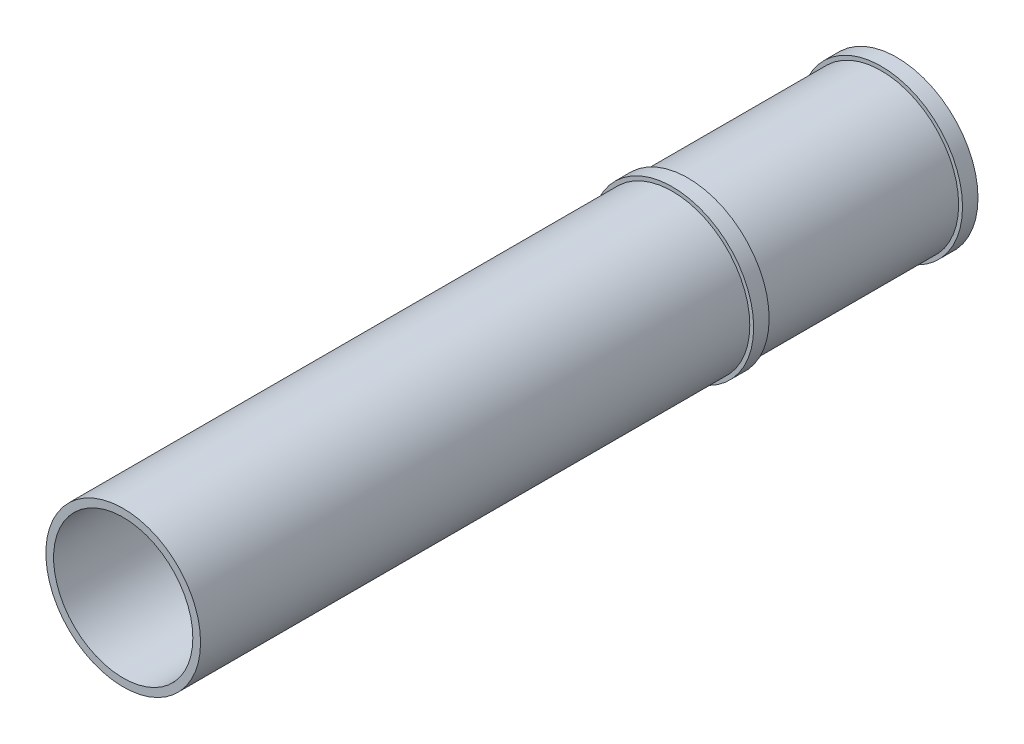
ISO-10303-21;
HEADER;
FILE_DESCRIPTION(('STEP AP214'),'2;1');
FILE_NAME('part.step','',(''),(''),'','','');
FILE_SCHEMA(('AUTOMOTIVE_DESIGN { 1 0 10303 214 1 1 1 1 }'));
ENDSEC;
DATA;
#1=APPLICATION_CONTEXT('core data for automotive mechanical design processes');
#2=APPLICATION_PROTOCOL_DEFINITION('international standard','automotive_design',2000,#1);
#3=PRODUCT_CONTEXT('',#1,'mechanical');
#4=PRODUCT('Part','Part','',(#3));
#5=PRODUCT_RELATED_PRODUCT_CATEGORY('part','',(#4));
#6=PRODUCT_DEFINITION_FORMATION('','',#4);
#7=PRODUCT_DEFINITION_CONTEXT('part definition',#1,'design');
#8=PRODUCT_DEFINITION('design','',#6,#7);
#9=PRODUCT_DEFINITION_SHAPE('','',#8);
#10=(LENGTH_UNIT() NAMED_UNIT(*) SI_UNIT(.MILLI.,.METRE.));
#11=(NAMED_UNIT(*) PLANE_ANGLE_UNIT() SI_UNIT($,.RADIAN.));
#12=(NAMED_UNIT(*) SI_UNIT($,.STERADIAN.) SOLID_ANGLE_UNIT());
#13=UNCERTAINTY_MEASURE_WITH_UNIT(LENGTH_MEASURE(1.E-05),#10,'distance_accuracy_value','');
#14=(GEOMETRIC_REPRESENTATION_CONTEXT(3) GLOBAL_UNCERTAINTY_ASSIGNED_CONTEXT((#13)) GLOBAL_UNIT_ASSIGNED_CONTEXT((#10,
#11,#12)) REPRESENTATION_CONTEXT('',''));
#15=CARTESIAN_POINT('',(0.,0.,0.));
#16=DIRECTION('',(0.,0.,1.));
#17=DIRECTION('',(1.,0.,0.));
#18=AXIS2_PLACEMENT_3D('',#15,#16,#17);
#19=CARTESIAN_POINT('',(0.,0.,200.));
#20=DIRECTION('',(0.,0.,-1.));
#21=DIRECTION('',(-1.,0.,0.));
#22=AXIS2_PLACEMENT_3D('',#19,#20,#21);
#23=CYLINDRICAL_SURFACE('',#22,20.);
#24=CARTESIAN_POINT('',(0.,0.,4.));
#25=DIRECTION('',(0.,0.,1.));
#26=DIRECTION('',(1.,0.,0.));
#27=AXIS2_PLACEMENT_3D('',#24,#25,#26);
#28=CIRCLE('',#27,20.);
#29=CARTESIAN_POINT('',(20.,0.,4.));
#30=VERTEX_POINT('',#29);
#31=EDGE_CURVE('E70',#30,#30,#28,.T.);
#32=ORIENTED_EDGE('',*,*,#31,.T.);
#33=EDGE_LOOP('',(#32));
#34=FACE_BOUND('',#33,.T.);
#35=CARTESIAN_POINT('',(0.,0.,54.));
#36=DIRECTION('',(0.,0.,1.));
#37=DIRECTION('',(1.,0.,0.));
#38=AXIS2_PLACEMENT_3D('',#35,#36,#37);
#39=CIRCLE('',#38,20.);
#40=CARTESIAN_POINT('',(20.,0.,54.));
#41=VERTEX_POINT('',#40);
#42=EDGE_CURVE('E10',#41,#41,#39,.T.);
#43=ORIENTED_EDGE('',*,*,#42,.F.);
#44=EDGE_LOOP('',(#43));
#45=FACE_BOUND('',#44,.T.);
#46=ADVANCED_FACE('F41',(#34,#45),#23,.T.);
#47=CARTESIAN_POINT('',(0.,0.,200.));
#48=DIRECTION('',(0.,0.,-1.));
#49=DIRECTION('',(-1.,0.,0.));
#50=AXIS2_PLACEMENT_3D('',#47,#48,#49);
#51=CYLINDRICAL_SURFACE('',#50,18.);
#52=CARTESIAN_POINT('',(0.,0.,200.));
#53=DIRECTION('',(0.,0.,1.));
#54=DIRECTION('',(1.,0.,0.));
#55=AXIS2_PLACEMENT_3D('',#52,#53,#54);
#56=CIRCLE('',#55,18.);
#57=CARTESIAN_POINT('',(18.,0.,200.));
#58=VERTEX_POINT('',#57);
#59=EDGE_CURVE('E54',#58,#58,#56,.T.);
#60=ORIENTED_EDGE('',*,*,#59,.T.);
#61=EDGE_LOOP('',(#60));
#62=FACE_BOUND('',#61,.T.);
#63=CARTESIAN_POINT('',(0.,0.,0.));
#64=DIRECTION('',(0.,0.,1.));
#65=DIRECTION('',(1.,0.,0.));
#66=AXIS2_PLACEMENT_3D('',#63,#64,#65);
#67=CIRCLE('',#66,18.);
#68=CARTESIAN_POINT('',(18.,0.,0.));
#69=VERTEX_POINT('',#68);
#70=EDGE_CURVE('E60',#69,#69,#67,.T.);
#71=ORIENTED_EDGE('',*,*,#70,.F.);
#72=EDGE_LOOP('',(#71));
#73=FACE_BOUND('',#72,.T.);
#74=ADVANCED_FACE('F43',(#62,#73),#51,.F.);
#75=CARTESIAN_POINT('',(0.,0.,58.));
#76=DIRECTION('',(0.,0.,1.));
#77=DIRECTION('',(1.,0.,0.));
#78=AXIS2_PLACEMENT_3D('',#75,#76,#77);
#79=CIRCLE('',#78,20.);
#80=CARTESIAN_POINT('',(20.,0.,58.));
#81=VERTEX_POINT('',#80);
#82=EDGE_CURVE('E86',#81,#81,#79,.T.);
#83=ORIENTED_EDGE('',*,*,#82,.T.);
#84=EDGE_LOOP('',(#83));
#85=FACE_BOUND('',#84,.T.);
#86=CARTESIAN_POINT('',(0.,0.,200.));
#87=DIRECTION('',(0.,0.,1.));
#88=DIRECTION('',(1.,0.,0.));
#89=AXIS2_PLACEMENT_3D('',#86,#87,#88);
#90=CIRCLE('',#89,20.);
#91=CARTESIAN_POINT('',(20.,0.,200.));
#92=VERTEX_POINT('',#91);
#93=EDGE_CURVE('E49',#92,#92,#90,.T.);
#94=ORIENTED_EDGE('',*,*,#93,.F.);
#95=EDGE_LOOP('',(#94));
#96=FACE_BOUND('',#95,.T.);
#97=ADVANCED_FACE('F112',(#85,#96),#23,.T.);
#98=CARTESIAN_POINT('',(0.,0.,200.));
#99=DIRECTION('',(0.,0.,1.));
#100=DIRECTION('',(1.,0.,0.));
#101=AXIS2_PLACEMENT_3D('',#98,#99,#100);
#102=PLANE('',#101);
#103=ORIENTED_EDGE('',*,*,#59,.F.);
#104=EDGE_LOOP('',(#103));
#105=FACE_BOUND('',#104,.T.);
#106=ORIENTED_EDGE('',*,*,#93,.T.);
#107=EDGE_LOOP('',(#106));
#108=FACE_BOUND('',#107,.T.);
#109=ADVANCED_FACE('F120',(#105,#108),#102,.T.);
#110=CARTESIAN_POINT('',(0.,0.,0.));
#111=DIRECTION('',(0.,0.,1.));
#112=DIRECTION('',(1.,0.,0.));
#113=AXIS2_PLACEMENT_3D('',#110,#111,#112);
#114=PLANE('',#113);
#115=ORIENTED_EDGE('',*,*,#70,.T.);
#116=EDGE_LOOP('',(#115));
#117=FACE_BOUND('',#116,.T.);
#118=CARTESIAN_POINT('',(0.,0.,0.));
#119=DIRECTION('',(0.,0.,1.));
#120=DIRECTION('',(1.,0.,0.));
#121=AXIS2_PLACEMENT_3D('',#118,#119,#120);
#122=CIRCLE('',#121,21.);
#123=CARTESIAN_POINT('',(21.,0.,0.));
#124=VERTEX_POINT('',#123);
#125=EDGE_CURVE('E76',#124,#124,#122,.T.);
#126=ORIENTED_EDGE('',*,*,#125,.F.);
#127=EDGE_LOOP('',(#126));
#128=FACE_BOUND('',#127,.T.);
#129=ADVANCED_FACE('F125',(#117,#128),#114,.F.);
#130=CARTESIAN_POINT('',(0.,0.,4.));
#131=DIRECTION('',(0.,0.,-1.));
#132=DIRECTION('',(-1.,0.,0.));
#133=AXIS2_PLACEMENT_3D('',#130,#131,#132);
#134=CYLINDRICAL_SURFACE('',#133,21.);
#135=CARTESIAN_POINT('',(0.,0.,4.));
#136=DIRECTION('',(0.,0.,1.));
#137=DIRECTION('',(1.,0.,0.));
#138=AXIS2_PLACEMENT_3D('',#135,#136,#137);
#139=CIRCLE('',#138,21.);
#140=CARTESIAN_POINT('',(21.,0.,4.));
#141=VERTEX_POINT('',#140);
#142=EDGE_CURVE('E65',#141,#141,#139,.T.);
#143=ORIENTED_EDGE('',*,*,#142,.F.);
#144=EDGE_LOOP('',(#143));
#145=FACE_BOUND('',#144,.T.);
#146=ORIENTED_EDGE('',*,*,#125,.T.);
#147=EDGE_LOOP('',(#146));
#148=FACE_BOUND('',#147,.T.);
#149=ADVANCED_FACE('F133',(#145,#148),#134,.T.);
#150=CARTESIAN_POINT('',(0.,0.,4.));
#151=DIRECTION('',(0.,0.,1.));
#152=DIRECTION('',(1.,0.,0.));
#153=AXIS2_PLACEMENT_3D('',#150,#151,#152);
#154=PLANE('',#153);
#155=ORIENTED_EDGE('',*,*,#31,.F.);
#156=EDGE_LOOP('',(#155));
#157=FACE_BOUND('',#156,.T.);
#158=ORIENTED_EDGE('',*,*,#142,.T.);
#159=EDGE_LOOP('',(#158));
#160=FACE_BOUND('',#159,.T.);
#161=ADVANCED_FACE('F138',(#157,#160),#154,.T.);
#162=CARTESIAN_POINT('',(0.,0.,58.));
#163=DIRECTION('',(0.,0.,-1.));
#164=DIRECTION('',(-1.,0.,0.));
#165=AXIS2_PLACEMENT_3D('',#162,#163,#164);
#166=CYLINDRICAL_SURFACE('',#165,21.);
#167=CARTESIAN_POINT('',(0.,0.,58.));
#168=DIRECTION('',(0.,0.,1.));
#169=DIRECTION('',(1.,0.,0.));
#170=AXIS2_PLACEMENT_3D('',#167,#168,#169);
#171=CIRCLE('',#170,21.);
#172=CARTESIAN_POINT('',(21.,0.,58.));
#173=VERTEX_POINT('',#172);
#174=EDGE_CURVE('E81',#173,#173,#171,.T.);
#175=ORIENTED_EDGE('',*,*,#174,.F.);
#176=EDGE_LOOP('',(#175));
#177=FACE_BOUND('',#176,.T.);
#178=CARTESIAN_POINT('',(0.,0.,54.));
#179=DIRECTION('',(0.,0.,1.));
#180=DIRECTION('',(1.,0.,0.));
#181=AXIS2_PLACEMENT_3D('',#178,#179,#180);
#182=CIRCLE('',#181,21.);
#183=CARTESIAN_POINT('',(21.,0.,54.));
#184=VERTEX_POINT('',#183);
#185=EDGE_CURVE('E92',#184,#184,#182,.T.);
#186=ORIENTED_EDGE('',*,*,#185,.T.);
#187=EDGE_LOOP('',(#186));
#188=FACE_BOUND('',#187,.T.);
#189=ADVANCED_FACE('F98',(#177,#188),#166,.T.);
#190=CARTESIAN_POINT('',(0.,0.,58.));
#191=DIRECTION('',(0.,0.,1.));
#192=DIRECTION('',(1.,0.,0.));
#193=AXIS2_PLACEMENT_3D('',#190,#191,#192);
#194=PLANE('',#193);
#195=ORIENTED_EDGE('',*,*,#82,.F.);
#196=EDGE_LOOP('',(#195));
#197=FACE_BOUND('',#196,.T.);
#198=ORIENTED_EDGE('',*,*,#174,.T.);
#199=EDGE_LOOP('',(#198));
#200=FACE_BOUND('',#199,.T.);
#201=ADVANCED_FACE('F102',(#197,#200),#194,.T.);
#202=CARTESIAN_POINT('',(0.,0.,54.));
#203=DIRECTION('',(0.,0.,1.));
#204=DIRECTION('',(1.,0.,0.));
#205=AXIS2_PLACEMENT_3D('',#202,#203,#204);
#206=PLANE('',#205);
#207=ORIENTED_EDGE('',*,*,#42,.T.);
#208=EDGE_LOOP('',(#207));
#209=FACE_BOUND('',#208,.T.);
#210=ORIENTED_EDGE('',*,*,#185,.F.);
#211=EDGE_LOOP('',(#210));
#212=FACE_BOUND('',#211,.T.);
#213=ADVANCED_FACE('F100',(#209,#212),#206,.F.);
#214=CLOSED_SHELL('',(#46,#74,#97,#109,#129,#149,#161,#189,#201,#213));
#215=MANIFOLD_SOLID_BREP('B2',#214);
#216=ADVANCED_BREP_SHAPE_REPRESENTATION('',(#18,#215),#14);
#217=SHAPE_DEFINITION_REPRESENTATION(#9,#216);
ENDSEC;
END-ISO-10303-21;
